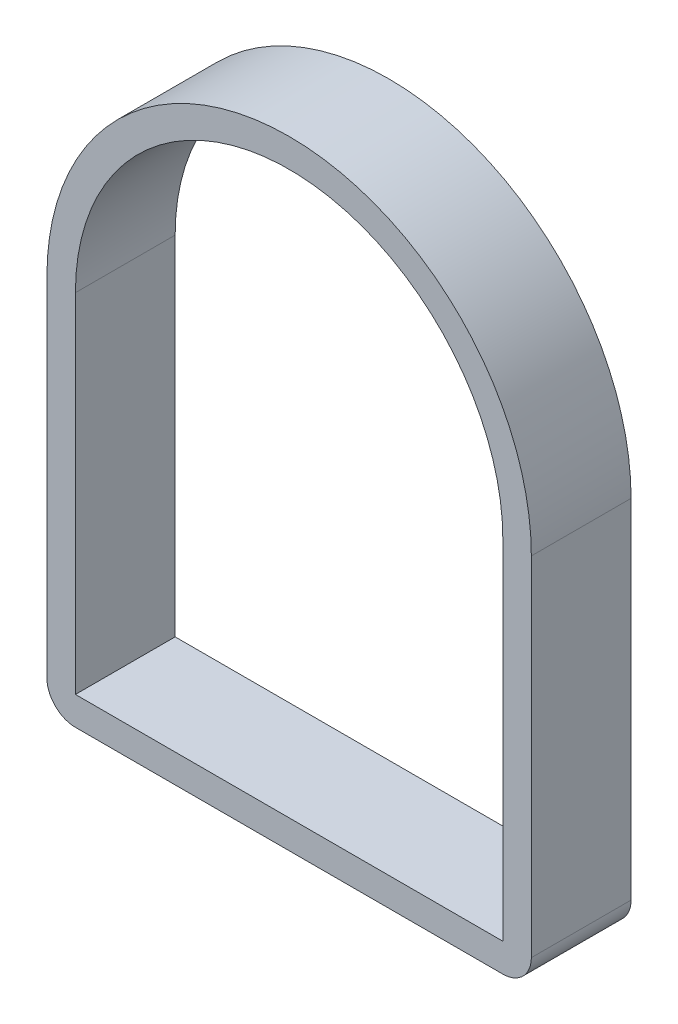
ISO-10303-21;
HEADER;
FILE_DESCRIPTION(('STEP AP214'),'2;1');
FILE_NAME('part.step','',(''),(''),'','','');
FILE_SCHEMA(('AUTOMOTIVE_DESIGN { 1 0 10303 214 1 1 1 1 }'));
ENDSEC;
DATA;
#1=APPLICATION_CONTEXT('core data for automotive mechanical design processes');
#2=APPLICATION_PROTOCOL_DEFINITION('international standard','automotive_design',2000,#1);
#3=PRODUCT_CONTEXT('',#1,'mechanical');
#4=PRODUCT('Part','Part','',(#3));
#5=PRODUCT_RELATED_PRODUCT_CATEGORY('part','',(#4));
#6=PRODUCT_DEFINITION_FORMATION('','',#4);
#7=PRODUCT_DEFINITION_CONTEXT('part definition',#1,'design');
#8=PRODUCT_DEFINITION('design','',#6,#7);
#9=PRODUCT_DEFINITION_SHAPE('','',#8);
#10=(LENGTH_UNIT() NAMED_UNIT(*) SI_UNIT(.MILLI.,.METRE.));
#11=(NAMED_UNIT(*) PLANE_ANGLE_UNIT() SI_UNIT($,.RADIAN.));
#12=(NAMED_UNIT(*) SI_UNIT($,.STERADIAN.) SOLID_ANGLE_UNIT());
#13=UNCERTAINTY_MEASURE_WITH_UNIT(LENGTH_MEASURE(1.E-05),#10,'distance_accuracy_value','');
#14=(GEOMETRIC_REPRESENTATION_CONTEXT(3) GLOBAL_UNCERTAINTY_ASSIGNED_CONTEXT((#13)) GLOBAL_UNIT_ASSIGNED_CONTEXT((#10,
#11,#12)) REPRESENTATION_CONTEXT('',''));
#15=CARTESIAN_POINT('',(0.,0.,0.));
#16=DIRECTION('',(0.,0.,1.));
#17=DIRECTION('',(1.,0.,0.));
#18=AXIS2_PLACEMENT_3D('',#15,#16,#17);
#19=CARTESIAN_POINT('',(1.49999999999995,-5.71500000000006,0.));
#20=DIRECTION('',(0.,0.,1.));
#21=DIRECTION('',(1.,0.,0.));
#22=AXIS2_PLACEMENT_3D('',#19,#20,#21);
#23=CYLINDRICAL_SURFACE('',#22,1.);
#24=CARTESIAN_POINT('',(1.49999999999995,-5.71500000000006,3.5));
#25=DIRECTION('',(0.,0.,-1.));
#26=DIRECTION('',(0.,-1.,0.));
#27=AXIS2_PLACEMENT_3D('',#24,#25,#26);
#28=CIRCLE('',#27,1.);
#29=CARTESIAN_POINT('',(1.49999999999995,-6.71500000000006,3.5));
#30=VERTEX_POINT('',#29);
#31=CARTESIAN_POINT('',(0.499999999999945,-5.71500000000009,3.5));
#32=VERTEX_POINT('',#31);
#33=EDGE_CURVE('E9',#30,#32,#28,.T.);
#34=ORIENTED_EDGE('',*,*,#33,.T.);
#35=DIRECTION('',(0.,0.,-1.));
#36=VECTOR('',#35,1.);
#37=CARTESIAN_POINT('',(0.499999999999945,-5.71500000000009,0.));
#38=LINE('',#37,#36);
#39=CARTESIAN_POINT('',(0.499999999999945,-5.71500000000009,0.));
#40=VERTEX_POINT('',#39);
#41=EDGE_CURVE('E25',#32,#40,#38,.T.);
#42=ORIENTED_EDGE('',*,*,#41,.T.);
#43=CARTESIAN_POINT('',(1.49999999999995,-5.71500000000006,0.));
#44=DIRECTION('',(0.,0.,1.));
#45=DIRECTION('',(1.,0.,0.));
#46=AXIS2_PLACEMENT_3D('',#43,#44,#45);
#47=CIRCLE('',#46,1.);
#48=CARTESIAN_POINT('',(1.49999999999995,-6.71500000000006,0.));
#49=VERTEX_POINT('',#48);
#50=EDGE_CURVE('E166',#40,#49,#47,.T.);
#51=ORIENTED_EDGE('',*,*,#50,.T.);
#52=DIRECTION('',(0.,0.,1.));
#53=VECTOR('',#52,1.);
#54=CARTESIAN_POINT('',(1.49999999999995,-6.71500000000006,0.));
#55=LINE('',#54,#53);
#56=EDGE_CURVE('E159',#49,#30,#55,.T.);
#57=ORIENTED_EDGE('',*,*,#56,.T.);
#58=EDGE_LOOP('',(#34,#42,#51,#57));
#59=FACE_BOUND('',#58,.T.);
#60=ADVANCED_FACE('F15',(#59),#23,.T.);
#61=CARTESIAN_POINT('',(0.499999999999978,-6.71500000000006,0.));
#62=DIRECTION('',(0.,-1.,0.));
#63=DIRECTION('',(1.,0.,0.));
#64=AXIS2_PLACEMENT_3D('',#61,#62,#63);
#65=PLANE('',#64);
#66=ORIENTED_EDGE('',*,*,#56,.F.);
#67=DIRECTION('',(-1.,0.,0.));
#68=VECTOR('',#67,1.);
#69=CARTESIAN_POINT('',(17.5000000000001,-6.71500000000006,0.));
#70=LINE('',#69,#68);
#71=CARTESIAN_POINT('',(16.5000000000001,-6.71500000000006,0.));
#72=VERTEX_POINT('',#71);
#73=EDGE_CURVE('E140',#72,#49,#70,.T.);
#74=ORIENTED_EDGE('',*,*,#73,.F.);
#75=DIRECTION('',(0.,0.,-1.));
#76=VECTOR('',#75,1.);
#77=CARTESIAN_POINT('',(16.5000000000001,-6.71500000000006,0.));
#78=LINE('',#77,#76);
#79=CARTESIAN_POINT('',(16.5000000000001,-6.71500000000006,3.5));
#80=VERTEX_POINT('',#79);
#81=EDGE_CURVE('E141',#80,#72,#78,.T.);
#82=ORIENTED_EDGE('',*,*,#81,.F.);
#83=DIRECTION('',(1.,0.,0.));
#84=VECTOR('',#83,1.);
#85=CARTESIAN_POINT('',(17.5000000000001,-6.71500000000006,3.5));
#86=LINE('',#85,#84);
#87=EDGE_CURVE('E107',#30,#80,#86,.T.);
#88=ORIENTED_EDGE('',*,*,#87,.F.);
#89=EDGE_LOOP('',(#66,#74,#82,#88));
#90=FACE_BOUND('',#89,.T.);
#91=ADVANCED_FACE('F176',(#90),#65,.T.);
#92=CARTESIAN_POINT('',(8.99999999999984,1.91338626431886,0.));
#93=DIRECTION('',(0.,0.,1.));
#94=DIRECTION('',(1.,0.,0.));
#95=AXIS2_PLACEMENT_3D('',#92,#93,#94);
#96=PLANE('',#95);
#97=DIRECTION('',(0.,-1.,0.));
#98=VECTOR('',#97,1.);
#99=CARTESIAN_POINT('',(1.49999999999968,4.20428839635095,0.));
#100=LINE('',#99,#98);
#101=CARTESIAN_POINT('',(1.4999999999996,6.4951905283833,0.));
#102=VERTEX_POINT('',#101);
#103=CARTESIAN_POINT('',(1.5,-5.715,0.));
#104=VERTEX_POINT('',#103);
#105=EDGE_CURVE('E157',#102,#104,#100,.T.);
#106=ORIENTED_EDGE('',*,*,#105,.T.);
#107=DIRECTION('',(1.,0.,0.));
#108=VECTOR('',#107,1.);
#109=CARTESIAN_POINT('',(5.24999999999992,-5.715,0.));
#110=LINE('',#109,#108);
#111=CARTESIAN_POINT('',(16.5,-5.715,0.));
#112=VERTEX_POINT('',#111);
#113=EDGE_CURVE('E154',#104,#112,#110,.T.);
#114=ORIENTED_EDGE('',*,*,#113,.T.);
#115=DIRECTION('',(0.,1.,0.));
#116=VECTOR('',#115,1.);
#117=CARTESIAN_POINT('',(16.4999999999999,-1.90080686784047,0.));
#118=LINE('',#117,#116);
#119=CARTESIAN_POINT('',(16.4999999999997,6.49519052838372,0.));
#120=VERTEX_POINT('',#119);
#121=EDGE_CURVE('E151',#112,#120,#118,.T.);
#122=ORIENTED_EDGE('',*,*,#121,.T.);
#123=CARTESIAN_POINT('',(8.99999999999963,6.49519052838351,0.));
#124=DIRECTION('',(0.,0.,1.));
#125=DIRECTION('',(1.,0.,0.));
#126=AXIS2_PLACEMENT_3D('',#123,#124,#125);
#127=CIRCLE('',#126,7.50000000000003);
#128=EDGE_CURVE('E149',#120,#102,#127,.T.);
#129=ORIENTED_EDGE('',*,*,#128,.T.);
#130=EDGE_LOOP('',(#106,#114,#122,#129));
#131=FACE_BOUND('',#130,.T.);
#132=ORIENTED_EDGE('',*,*,#50,.F.);
#133=DIRECTION('',(0.,1.,0.));
#134=VECTOR('',#133,1.);
#135=CARTESIAN_POINT('',(0.499999999999978,-6.71500000000006,0.));
#136=LINE('',#135,#134);
#137=CARTESIAN_POINT('',(0.499999999999546,6.49519052838323,0.));
#138=VERTEX_POINT('',#137);
#139=EDGE_CURVE('E147',#40,#138,#136,.T.);
#140=ORIENTED_EDGE('',*,*,#139,.T.);
#141=CARTESIAN_POINT('',(8.99999999999963,6.49519052838351,0.));
#142=DIRECTION('',(0.,0.,-1.));
#143=DIRECTION('',(0.,-1.,0.));
#144=AXIS2_PLACEMENT_3D('',#141,#142,#143);
#145=CIRCLE('',#144,8.50000000000009);
#146=CARTESIAN_POINT('',(17.4999999999997,6.49519052838378,0.));
#147=VERTEX_POINT('',#146);
#148=EDGE_CURVE('E104',#138,#147,#145,.T.);
#149=ORIENTED_EDGE('',*,*,#148,.T.);
#150=DIRECTION('',(0.,-1.,0.));
#151=VECTOR('',#150,1.);
#152=CARTESIAN_POINT('',(17.4999999999997,6.49519052838378,0.));
#153=LINE('',#152,#151);
#154=CARTESIAN_POINT('',(17.5000000000001,-5.71500000000003,0.));
#155=VERTEX_POINT('',#154);
#156=EDGE_CURVE('E143',#147,#155,#153,.T.);
#157=ORIENTED_EDGE('',*,*,#156,.T.);
#158=CARTESIAN_POINT('',(16.5000000000001,-5.71500000000006,0.));
#159=DIRECTION('',(0.,0.,1.));
#160=DIRECTION('',(1.,0.,0.));
#161=AXIS2_PLACEMENT_3D('',#158,#159,#160);
#162=CIRCLE('',#161,1.);
#163=EDGE_CURVE('E136',#72,#155,#162,.T.);
#164=ORIENTED_EDGE('',*,*,#163,.F.);
#165=ORIENTED_EDGE('',*,*,#73,.T.);
#166=EDGE_LOOP('',(#132,#140,#149,#157,#164,#165));
#167=FACE_BOUND('',#166,.T.);
#168=ADVANCED_FACE('F171',(#131,#167),#96,.F.);
#169=CARTESIAN_POINT('',(16.5000000000001,-5.71500000000006,0.));
#170=DIRECTION('',(0.,0.,1.));
#171=DIRECTION('',(1.,0.,0.));
#172=AXIS2_PLACEMENT_3D('',#169,#170,#171);
#173=CYLINDRICAL_SURFACE('',#172,1.);
#174=CARTESIAN_POINT('',(16.5000000000001,-5.71500000000006,3.5));
#175=DIRECTION('',(0.,0.,-1.));
#176=DIRECTION('',(0.,-1.,0.));
#177=AXIS2_PLACEMENT_3D('',#174,#175,#176);
#178=CIRCLE('',#177,1.);
#179=CARTESIAN_POINT('',(17.5000000000001,-5.71500000000003,3.5));
#180=VERTEX_POINT('',#179);
#181=EDGE_CURVE('E137',#180,#80,#178,.T.);
#182=ORIENTED_EDGE('',*,*,#181,.T.);
#183=ORIENTED_EDGE('',*,*,#81,.T.);
#184=ORIENTED_EDGE('',*,*,#163,.T.);
#185=DIRECTION('',(0.,0.,1.));
#186=VECTOR('',#185,1.);
#187=CARTESIAN_POINT('',(17.5000000000001,-5.71500000000003,0.));
#188=LINE('',#187,#186);
#189=EDGE_CURVE('E134',#155,#180,#188,.T.);
#190=ORIENTED_EDGE('',*,*,#189,.T.);
#191=EDGE_LOOP('',(#182,#183,#184,#190));
#192=FACE_BOUND('',#191,.T.);
#193=ADVANCED_FACE('F182',(#192),#173,.T.);
#194=CARTESIAN_POINT('',(1.4999999999996,6.4951905283833,0.));
#195=DIRECTION('',(-1.,0.,0.));
#196=DIRECTION('',(0.,-1.,0.));
#197=AXIS2_PLACEMENT_3D('',#194,#195,#196);
#198=PLANE('',#197);
#199=ORIENTED_EDGE('',*,*,#105,.F.);
#200=DIRECTION('',(0.,0.,1.));
#201=VECTOR('',#200,1.);
#202=CARTESIAN_POINT('',(1.4999999999996,6.4951905283833,0.));
#203=LINE('',#202,#201);
#204=CARTESIAN_POINT('',(1.4999999999996,6.4951905283833,3.5));
#205=VERTEX_POINT('',#204);
#206=EDGE_CURVE('E128',#102,#205,#203,.T.);
#207=ORIENTED_EDGE('',*,*,#206,.T.);
#208=DIRECTION('',(0.,1.,0.));
#209=VECTOR('',#208,1.);
#210=CARTESIAN_POINT('',(1.49999999999968,4.20428839635095,3.5));
#211=LINE('',#210,#209);
#212=CARTESIAN_POINT('',(1.5,-5.715,3.5));
#213=VERTEX_POINT('',#212);
#214=EDGE_CURVE('E98',#213,#205,#211,.T.);
#215=ORIENTED_EDGE('',*,*,#214,.F.);
#216=DIRECTION('',(0.,0.,1.));
#217=VECTOR('',#216,1.);
#218=CARTESIAN_POINT('',(1.5,-5.715,0.));
#219=LINE('',#218,#217);
#220=EDGE_CURVE('E114',#104,#213,#219,.T.);
#221=ORIENTED_EDGE('',*,*,#220,.F.);
#222=EDGE_LOOP('',(#199,#207,#215,#221));
#223=FACE_BOUND('',#222,.T.);
#224=ADVANCED_FACE('F184',(#223),#198,.F.);
#225=CARTESIAN_POINT('',(8.99999999999963,6.49519052838351,0.));
#226=DIRECTION('',(0.,0.,1.));
#227=DIRECTION('',(1.,0.,0.));
#228=AXIS2_PLACEMENT_3D('',#225,#226,#227);
#229=CYLINDRICAL_SURFACE('',#228,7.50000000000003);
#230=ORIENTED_EDGE('',*,*,#128,.F.);
#231=DIRECTION('',(0.,0.,1.));
#232=VECTOR('',#231,1.);
#233=CARTESIAN_POINT('',(16.4999999999997,6.49519052838372,0.));
#234=LINE('',#233,#232);
#235=CARTESIAN_POINT('',(16.4999999999997,6.49519052838372,3.5));
#236=VERTEX_POINT('',#235);
#237=EDGE_CURVE('E124',#120,#236,#234,.T.);
#238=ORIENTED_EDGE('',*,*,#237,.T.);
#239=CARTESIAN_POINT('',(8.99999999999963,6.49519052838351,3.5));
#240=DIRECTION('',(0.,0.,-1.));
#241=DIRECTION('',(0.,-1.,0.));
#242=AXIS2_PLACEMENT_3D('',#239,#240,#241);
#243=CIRCLE('',#242,7.50000000000003);
#244=EDGE_CURVE('E120',#205,#236,#243,.T.);
#245=ORIENTED_EDGE('',*,*,#244,.F.);
#246=ORIENTED_EDGE('',*,*,#206,.F.);
#247=EDGE_LOOP('',(#230,#238,#245,#246));
#248=FACE_BOUND('',#247,.T.);
#249=ADVANCED_FACE('F190',(#248),#229,.F.);
#250=CARTESIAN_POINT('',(16.5,-5.715,0.));
#251=DIRECTION('',(1.,0.,0.));
#252=DIRECTION('',(0.,1.,0.));
#253=AXIS2_PLACEMENT_3D('',#250,#251,#252);
#254=PLANE('',#253);
#255=ORIENTED_EDGE('',*,*,#121,.F.);
#256=DIRECTION('',(0.,0.,1.));
#257=VECTOR('',#256,1.);
#258=CARTESIAN_POINT('',(16.5,-5.715,0.));
#259=LINE('',#258,#257);
#260=CARTESIAN_POINT('',(16.5,-5.715,3.5));
#261=VERTEX_POINT('',#260);
#262=EDGE_CURVE('E121',#112,#261,#259,.T.);
#263=ORIENTED_EDGE('',*,*,#262,.T.);
#264=DIRECTION('',(0.,-1.,0.));
#265=VECTOR('',#264,1.);
#266=CARTESIAN_POINT('',(16.4999999999999,-1.90080686784047,3.5));
#267=LINE('',#266,#265);
#268=EDGE_CURVE('E118',#236,#261,#267,.T.);
#269=ORIENTED_EDGE('',*,*,#268,.F.);
#270=ORIENTED_EDGE('',*,*,#237,.F.);
#271=EDGE_LOOP('',(#255,#263,#269,#270));
#272=FACE_BOUND('',#271,.T.);
#273=ADVANCED_FACE('F205',(#272),#254,.F.);
#274=CARTESIAN_POINT('',(1.5,-5.715,0.));
#275=DIRECTION('',(0.,-1.,0.));
#276=DIRECTION('',(0.,0.,-1.));
#277=AXIS2_PLACEMENT_3D('',#274,#275,#276);
#278=PLANE('',#277);
#279=ORIENTED_EDGE('',*,*,#113,.F.);
#280=ORIENTED_EDGE('',*,*,#220,.T.);
#281=DIRECTION('',(-1.,0.,0.));
#282=VECTOR('',#281,1.);
#283=CARTESIAN_POINT('',(5.24999999999992,-5.715,3.5));
#284=LINE('',#283,#282);
#285=EDGE_CURVE('E115',#261,#213,#284,.T.);
#286=ORIENTED_EDGE('',*,*,#285,.F.);
#287=ORIENTED_EDGE('',*,*,#262,.F.);
#288=EDGE_LOOP('',(#279,#280,#286,#287));
#289=FACE_BOUND('',#288,.T.);
#290=ADVANCED_FACE('F210',(#289),#278,.F.);
#291=CARTESIAN_POINT('',(17.5000000000001,-6.71500000000006,0.));
#292=DIRECTION('',(1.,0.,0.));
#293=DIRECTION('',(0.,1.,0.));
#294=AXIS2_PLACEMENT_3D('',#291,#292,#293);
#295=PLANE('',#294);
#296=ORIENTED_EDGE('',*,*,#189,.F.);
#297=ORIENTED_EDGE('',*,*,#156,.F.);
#298=DIRECTION('',(0.,0.,1.));
#299=VECTOR('',#298,1.);
#300=CARTESIAN_POINT('',(17.4999999999997,6.49519052838378,0.));
#301=LINE('',#300,#299);
#302=CARTESIAN_POINT('',(17.4999999999997,6.49519052838378,3.5));
#303=VERTEX_POINT('',#302);
#304=EDGE_CURVE('E106',#147,#303,#301,.T.);
#305=ORIENTED_EDGE('',*,*,#304,.T.);
#306=DIRECTION('',(0.,1.,0.));
#307=VECTOR('',#306,1.);
#308=CARTESIAN_POINT('',(17.4999999999997,6.49519052838378,3.5));
#309=LINE('',#308,#307);
#310=EDGE_CURVE('E89',#180,#303,#309,.T.);
#311=ORIENTED_EDGE('',*,*,#310,.F.);
#312=EDGE_LOOP('',(#296,#297,#305,#311));
#313=FACE_BOUND('',#312,.T.);
#314=ADVANCED_FACE('F181',(#313),#295,.T.);
#315=CARTESIAN_POINT('',(0.499999999999546,6.49519052838322,0.));
#316=DIRECTION('',(-1.,0.,0.));
#317=DIRECTION('',(0.,-1.,0.));
#318=AXIS2_PLACEMENT_3D('',#315,#316,#317);
#319=PLANE('',#318);
#320=ORIENTED_EDGE('',*,*,#41,.F.);
#321=DIRECTION('',(0.,-1.,0.));
#322=VECTOR('',#321,1.);
#323=CARTESIAN_POINT('',(0.499999999999978,-6.71500000000006,3.5));
#324=LINE('',#323,#322);
#325=CARTESIAN_POINT('',(0.499999999999546,6.49519052838323,3.5));
#326=VERTEX_POINT('',#325);
#327=EDGE_CURVE('E93',#326,#32,#324,.T.);
#328=ORIENTED_EDGE('',*,*,#327,.F.);
#329=DIRECTION('',(0.,0.,1.));
#330=VECTOR('',#329,1.);
#331=CARTESIAN_POINT('',(0.499999999999546,6.49519052838323,0.));
#332=LINE('',#331,#330);
#333=EDGE_CURVE('E96',#138,#326,#332,.T.);
#334=ORIENTED_EDGE('',*,*,#333,.F.);
#335=ORIENTED_EDGE('',*,*,#139,.F.);
#336=EDGE_LOOP('',(#320,#328,#334,#335));
#337=FACE_BOUND('',#336,.T.);
#338=ADVANCED_FACE('F95',(#337),#319,.T.);
#339=CARTESIAN_POINT('',(8.99999999999963,6.49519052838351,0.));
#340=DIRECTION('',(0.,0.,1.));
#341=DIRECTION('',(1.,0.,0.));
#342=AXIS2_PLACEMENT_3D('',#339,#340,#341);
#343=CYLINDRICAL_SURFACE('',#342,8.50000000000009);
#344=ORIENTED_EDGE('',*,*,#148,.F.);
#345=ORIENTED_EDGE('',*,*,#333,.T.);
#346=CARTESIAN_POINT('',(8.99999999999963,6.49519052838351,3.5));
#347=DIRECTION('',(0.,0.,1.));
#348=DIRECTION('',(1.,0.,0.));
#349=AXIS2_PLACEMENT_3D('',#346,#347,#348);
#350=CIRCLE('',#349,8.50000000000009);
#351=EDGE_CURVE('E19',#303,#326,#350,.T.);
#352=ORIENTED_EDGE('',*,*,#351,.F.);
#353=ORIENTED_EDGE('',*,*,#304,.F.);
#354=EDGE_LOOP('',(#344,#345,#352,#353));
#355=FACE_BOUND('',#354,.T.);
#356=ADVANCED_FACE('F17',(#355),#343,.T.);
#357=CARTESIAN_POINT('',(8.99999999999984,1.91338626431886,3.5));
#358=DIRECTION('',(0.,0.,1.));
#359=DIRECTION('',(1.,0.,0.));
#360=AXIS2_PLACEMENT_3D('',#357,#358,#359);
#361=PLANE('',#360);
#362=ORIENTED_EDGE('',*,*,#33,.F.);
#363=ORIENTED_EDGE('',*,*,#87,.T.);
#364=ORIENTED_EDGE('',*,*,#181,.F.);
#365=ORIENTED_EDGE('',*,*,#310,.T.);
#366=ORIENTED_EDGE('',*,*,#351,.T.);
#367=ORIENTED_EDGE('',*,*,#327,.T.);
#368=EDGE_LOOP('',(#362,#363,#364,#365,#366,#367));
#369=FACE_BOUND('',#368,.T.);
#370=ORIENTED_EDGE('',*,*,#214,.T.);
#371=ORIENTED_EDGE('',*,*,#244,.T.);
#372=ORIENTED_EDGE('',*,*,#268,.T.);
#373=ORIENTED_EDGE('',*,*,#285,.T.);
#374=EDGE_LOOP('',(#370,#371,#372,#373));
#375=FACE_BOUND('',#374,.T.);
#376=ADVANCED_FACE('F108',(#369,#375),#361,.T.);
#377=CLOSED_SHELL('',(#60,#91,#168,#193,#224,#249,#273,#290,#314,#338,#356,#376));
#378=MANIFOLD_SOLID_BREP('B1',#377);
#379=ADVANCED_BREP_SHAPE_REPRESENTATION('',(#18,#378),#14);
#380=SHAPE_DEFINITION_REPRESENTATION(#9,#379);
ENDSEC;
END-ISO-10303-21;
